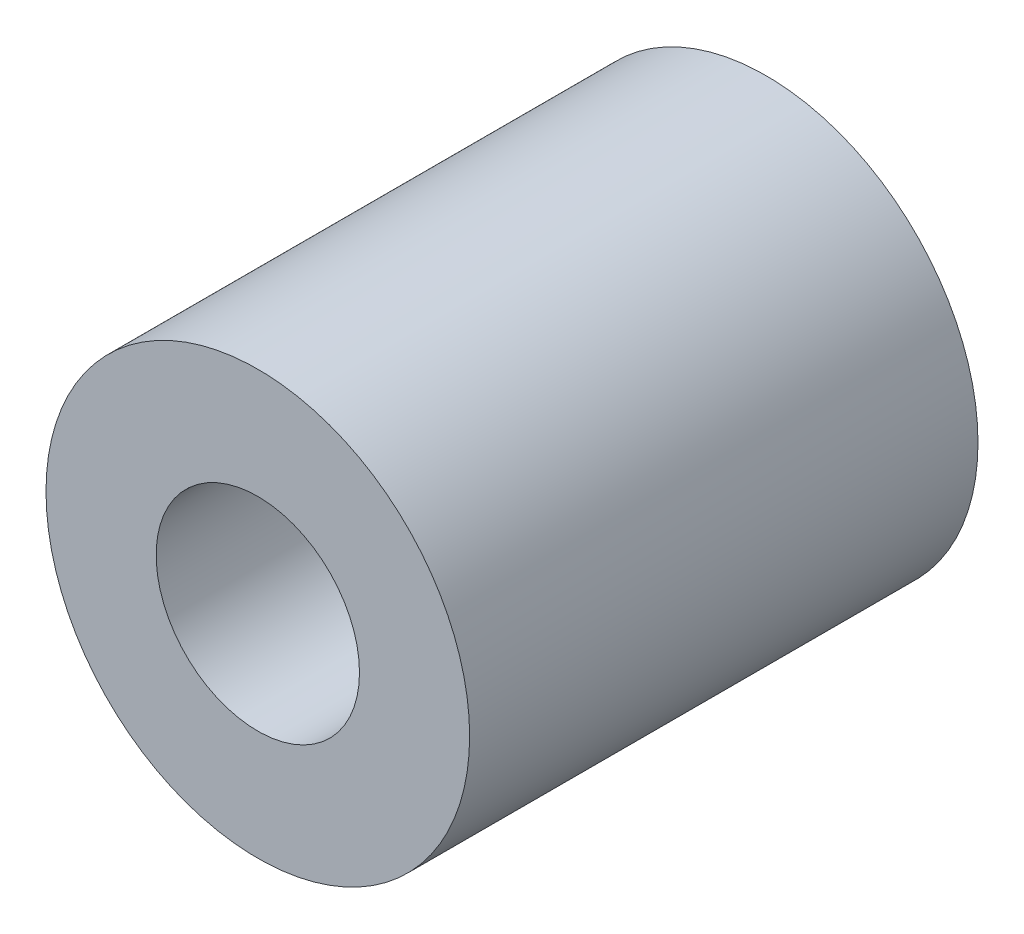
ISO-10303-21;
HEADER;
FILE_DESCRIPTION(('STEP AP214'),'2;1');
FILE_NAME('part.step','',(''),(''),'','','');
FILE_SCHEMA(('AUTOMOTIVE_DESIGN { 1 0 10303 214 1 1 1 1 }'));
ENDSEC;
DATA;
#1=APPLICATION_CONTEXT('core data for automotive mechanical design processes');
#2=APPLICATION_PROTOCOL_DEFINITION('international standard','automotive_design',2000,#1);
#3=PRODUCT_CONTEXT('',#1,'mechanical');
#4=PRODUCT('Part','Part','',(#3));
#5=PRODUCT_RELATED_PRODUCT_CATEGORY('part','',(#4));
#6=PRODUCT_DEFINITION_FORMATION('','',#4);
#7=PRODUCT_DEFINITION_CONTEXT('part definition',#1,'design');
#8=PRODUCT_DEFINITION('design','',#6,#7);
#9=PRODUCT_DEFINITION_SHAPE('','',#8);
#10=(LENGTH_UNIT() NAMED_UNIT(*) SI_UNIT(.MILLI.,.METRE.));
#11=(NAMED_UNIT(*) PLANE_ANGLE_UNIT() SI_UNIT($,.RADIAN.));
#12=(NAMED_UNIT(*) SI_UNIT($,.STERADIAN.) SOLID_ANGLE_UNIT());
#13=UNCERTAINTY_MEASURE_WITH_UNIT(LENGTH_MEASURE(1.E-05),#10,'distance_accuracy_value','');
#14=(GEOMETRIC_REPRESENTATION_CONTEXT(3) GLOBAL_UNCERTAINTY_ASSIGNED_CONTEXT((#13)) GLOBAL_UNIT_ASSIGNED_CONTEXT((#10,
#11,#12)) REPRESENTATION_CONTEXT('',''));
#15=CARTESIAN_POINT('',(0.,0.,0.));
#16=DIRECTION('',(0.,0.,1.));
#17=DIRECTION('',(1.,0.,0.));
#18=AXIS2_PLACEMENT_3D('',#15,#16,#17);
#19=CARTESIAN_POINT('',(0.,0.,30.));
#20=DIRECTION('',(0.,0.,1.));
#21=DIRECTION('',(1.,0.,0.));
#22=AXIS2_PLACEMENT_3D('',#19,#20,#21);
#23=PLANE('',#22);
#24=CARTESIAN_POINT('',(0.,0.,30.));
#25=DIRECTION('',(0.,0.,1.));
#26=DIRECTION('',(1.,0.,0.));
#27=AXIS2_PLACEMENT_3D('',#24,#25,#26);
#28=CIRCLE('',#27,12.5);
#29=CARTESIAN_POINT('',(12.5,0.,30.));
#30=VERTEX_POINT('',#29);
#31=EDGE_CURVE('E10',#30,#30,#28,.T.);
#32=ORIENTED_EDGE('',*,*,#31,.T.);
#33=EDGE_LOOP('',(#32));
#34=FACE_BOUND('',#33,.T.);
#35=CARTESIAN_POINT('',(0.,0.,30.));
#36=DIRECTION('',(0.,0.,1.));
#37=DIRECTION('',(1.,0.,0.));
#38=AXIS2_PLACEMENT_3D('',#35,#36,#37);
#39=CIRCLE('',#38,6.);
#40=CARTESIAN_POINT('',(6.,0.,30.));
#41=VERTEX_POINT('',#40);
#42=EDGE_CURVE('E42',#41,#41,#39,.T.);
#43=ORIENTED_EDGE('',*,*,#42,.F.);
#44=EDGE_LOOP('',(#43));
#45=FACE_BOUND('',#44,.T.);
#46=ADVANCED_FACE('F31',(#34,#45),#23,.T.);
#47=CARTESIAN_POINT('',(0.,0.,0.));
#48=DIRECTION('',(0.,0.,1.));
#49=DIRECTION('',(1.,0.,0.));
#50=AXIS2_PLACEMENT_3D('',#47,#48,#49);
#51=PLANE('',#50);
#52=CARTESIAN_POINT('',(0.,0.,0.));
#53=DIRECTION('',(0.,0.,1.));
#54=DIRECTION('',(1.,0.,0.));
#55=AXIS2_PLACEMENT_3D('',#52,#53,#54);
#56=CIRCLE('',#55,12.5);
#57=CARTESIAN_POINT('',(12.5,0.,0.));
#58=VERTEX_POINT('',#57);
#59=EDGE_CURVE('E35',#58,#58,#56,.T.);
#60=ORIENTED_EDGE('',*,*,#59,.F.);
#61=EDGE_LOOP('',(#60));
#62=FACE_BOUND('',#61,.T.);
#63=CARTESIAN_POINT('',(0.,0.,0.));
#64=DIRECTION('',(0.,0.,1.));
#65=DIRECTION('',(1.,0.,0.));
#66=AXIS2_PLACEMENT_3D('',#63,#64,#65);
#67=CIRCLE('',#66,6.);
#68=CARTESIAN_POINT('',(6.,0.,0.));
#69=VERTEX_POINT('',#68);
#70=EDGE_CURVE('E44',#69,#69,#67,.T.);
#71=ORIENTED_EDGE('',*,*,#70,.T.);
#72=EDGE_LOOP('',(#71));
#73=FACE_BOUND('',#72,.T.);
#74=ADVANCED_FACE('F54',(#62,#73),#51,.F.);
#75=CARTESIAN_POINT('',(0.,0.,30.));
#76=DIRECTION('',(0.,0.,-1.));
#77=DIRECTION('',(-1.,0.,0.));
#78=AXIS2_PLACEMENT_3D('',#75,#76,#77);
#79=CYLINDRICAL_SURFACE('',#78,12.5);
#80=ORIENTED_EDGE('',*,*,#31,.F.);
#81=EDGE_LOOP('',(#80));
#82=FACE_BOUND('',#81,.T.);
#83=ORIENTED_EDGE('',*,*,#59,.T.);
#84=EDGE_LOOP('',(#83));
#85=FACE_BOUND('',#84,.T.);
#86=ADVANCED_FACE('F33',(#82,#85),#79,.T.);
#87=CARTESIAN_POINT('',(0.,0.,30.));
#88=DIRECTION('',(0.,0.,-1.));
#89=DIRECTION('',(-1.,0.,0.));
#90=AXIS2_PLACEMENT_3D('',#87,#88,#89);
#91=CYLINDRICAL_SURFACE('',#90,6.);
#92=ORIENTED_EDGE('',*,*,#42,.T.);
#93=EDGE_LOOP('',(#92));
#94=FACE_BOUND('',#93,.T.);
#95=ORIENTED_EDGE('',*,*,#70,.F.);
#96=EDGE_LOOP('',(#95));
#97=FACE_BOUND('',#96,.T.);
#98=ADVANCED_FACE('F50',(#94,#97),#91,.F.);
#99=CLOSED_SHELL('',(#46,#74,#86,#98));
#100=MANIFOLD_SOLID_BREP('B2',#99);
#101=ADVANCED_BREP_SHAPE_REPRESENTATION('',(#18,#100),#14);
#102=SHAPE_DEFINITION_REPRESENTATION(#9,#101);
ENDSEC;
END-ISO-10303-21;
